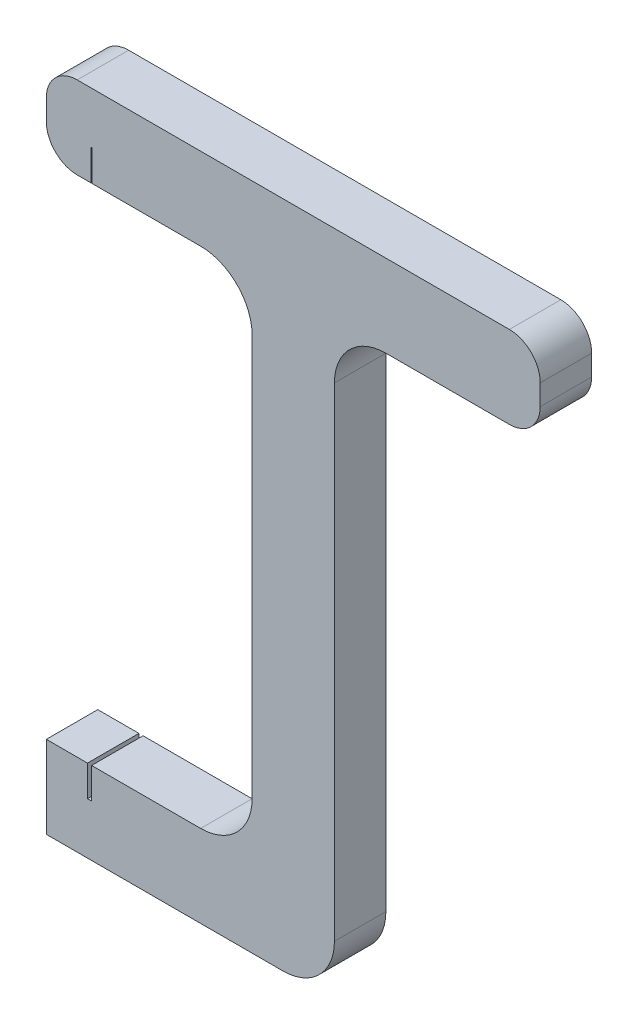
ISO-10303-21;
HEADER;
FILE_DESCRIPTION(('STEP AP214'),'2;1');
FILE_NAME('part.step','',(''),(''),'','','');
FILE_SCHEMA(('AUTOMOTIVE_DESIGN { 1 0 10303 214 1 1 1 1 }'));
ENDSEC;
DATA;
#1=APPLICATION_CONTEXT('core data for automotive mechanical design processes');
#2=APPLICATION_PROTOCOL_DEFINITION('international standard','automotive_design',2000,#1);
#3=PRODUCT_CONTEXT('',#1,'mechanical');
#4=PRODUCT('Part','Part','',(#3));
#5=PRODUCT_RELATED_PRODUCT_CATEGORY('part','',(#4));
#6=PRODUCT_DEFINITION_FORMATION('','',#4);
#7=PRODUCT_DEFINITION_CONTEXT('part definition',#1,'design');
#8=PRODUCT_DEFINITION('design','',#6,#7);
#9=PRODUCT_DEFINITION_SHAPE('','',#8);
#10=(LENGTH_UNIT() NAMED_UNIT(*) SI_UNIT(.MILLI.,.METRE.));
#11=(NAMED_UNIT(*) PLANE_ANGLE_UNIT() SI_UNIT($,.RADIAN.));
#12=(NAMED_UNIT(*) SI_UNIT($,.STERADIAN.) SOLID_ANGLE_UNIT());
#13=UNCERTAINTY_MEASURE_WITH_UNIT(LENGTH_MEASURE(1.E-05),#10,'distance_accuracy_value','');
#14=(GEOMETRIC_REPRESENTATION_CONTEXT(3) GLOBAL_UNCERTAINTY_ASSIGNED_CONTEXT((#13)) GLOBAL_UNIT_ASSIGNED_CONTEXT((#10,
#11,#12)) REPRESENTATION_CONTEXT('',''));
#15=CARTESIAN_POINT('',(0.,0.,0.));
#16=DIRECTION('',(0.,0.,1.));
#17=DIRECTION('',(1.,0.,0.));
#18=AXIS2_PLACEMENT_3D('',#15,#16,#17);
#19=CARTESIAN_POINT('',(-28.,57.,5.));
#20=DIRECTION('',(0.,1.,0.));
#21=DIRECTION('',(0.,0.,1.));
#22=AXIS2_PLACEMENT_3D('',#19,#20,#21);
#23=PLANE('',#22);
#24=DIRECTION('',(1.,0.,0.));
#25=VECTOR('',#24,1.);
#26=CARTESIAN_POINT('',(-28.,57.,0.));
#27=LINE('',#26,#25);
#28=CARTESIAN_POINT('',(-23.55,57.,0.));
#29=VERTEX_POINT('',#28);
#30=CARTESIAN_POINT('',(-13.,57.,0.));
#31=VERTEX_POINT('',#30);
#32=EDGE_CURVE('E316',#29,#31,#27,.T.);
#33=ORIENTED_EDGE('',*,*,#32,.T.);
#34=DIRECTION('',(0.,0.,-1.));
#35=VECTOR('',#34,1.);
#36=CARTESIAN_POINT('',(-13.,57.,5.));
#37=LINE('',#36,#35);
#38=CARTESIAN_POINT('',(-13.,57.,5.));
#39=VERTEX_POINT('',#38);
#40=EDGE_CURVE('E356',#31,#39,#37,.F.);
#41=ORIENTED_EDGE('',*,*,#40,.T.);
#42=DIRECTION('',(1.,0.,0.));
#43=VECTOR('',#42,1.);
#44=CARTESIAN_POINT('',(-28.,57.,5.));
#45=LINE('',#44,#43);
#46=CARTESIAN_POINT('',(-23.55,57.,4.99999999999999));
#47=VERTEX_POINT('',#46);
#48=EDGE_CURVE('E288',#47,#39,#45,.T.);
#49=ORIENTED_EDGE('',*,*,#48,.F.);
#50=DIRECTION('',(0.,0.,1.));
#51=VECTOR('',#50,1.);
#52=CARTESIAN_POINT('',(-23.55,57.,4.99999999999999));
#53=LINE('',#52,#51);
#54=EDGE_CURVE('E213',#29,#47,#53,.T.);
#55=ORIENTED_EDGE('',*,*,#54,.F.);
#56=EDGE_LOOP('',(#33,#41,#49,#55));
#57=FACE_BOUND('',#56,.T.);
#58=ADVANCED_FACE('F33',(#57),#23,.F.);
#59=CARTESIAN_POINT('',(-7.99999999999999,8.,5.));
#60=DIRECTION('',(0.,-1.,0.));
#61=DIRECTION('',(1.,0.,0.));
#62=AXIS2_PLACEMENT_3D('',#59,#60,#61);
#63=PLANE('',#62);
#64=DIRECTION('',(-1.,0.,0.));
#65=VECTOR('',#64,1.);
#66=CARTESIAN_POINT('',(-7.99999999999999,8.,5.));
#67=LINE('',#66,#65);
#68=CARTESIAN_POINT('',(-13.,8.,5.));
#69=VERTEX_POINT('',#68);
#70=CARTESIAN_POINT('',(-23.6,8.,5.));
#71=VERTEX_POINT('',#70);
#72=EDGE_CURVE('E295',#69,#71,#67,.T.);
#73=ORIENTED_EDGE('',*,*,#72,.F.);
#74=DIRECTION('',(0.,0.,-1.));
#75=VECTOR('',#74,1.);
#76=CARTESIAN_POINT('',(-13.,8.,0.));
#77=LINE('',#76,#75);
#78=CARTESIAN_POINT('',(-13.,8.,0.));
#79=VERTEX_POINT('',#78);
#80=EDGE_CURVE('E345',#69,#79,#77,.T.);
#81=ORIENTED_EDGE('',*,*,#80,.T.);
#82=DIRECTION('',(-1.,0.,0.));
#83=VECTOR('',#82,1.);
#84=CARTESIAN_POINT('',(-7.99999999999999,8.,0.));
#85=LINE('',#84,#83);
#86=CARTESIAN_POINT('',(-23.6,8.,0.));
#87=VERTEX_POINT('',#86);
#88=EDGE_CURVE('E323',#79,#87,#85,.T.);
#89=ORIENTED_EDGE('',*,*,#88,.T.);
#90=DIRECTION('',(0.,0.,-1.));
#91=VECTOR('',#90,1.);
#92=CARTESIAN_POINT('',(-23.6,8.,5.));
#93=LINE('',#92,#91);
#94=EDGE_CURVE('E242',#71,#87,#93,.T.);
#95=ORIENTED_EDGE('',*,*,#94,.F.);
#96=EDGE_LOOP('',(#73,#81,#89,#95));
#97=FACE_BOUND('',#96,.T.);
#98=ADVANCED_FACE('F436',(#97),#63,.F.);
#99=CARTESIAN_POINT('',(0.,0.,5.));
#100=DIRECTION('',(-1.,0.,0.));
#101=DIRECTION('',(0.,0.,1.));
#102=AXIS2_PLACEMENT_3D('',#99,#100,#101);
#103=PLANE('',#102);
#104=DIRECTION('',(0.,1.,0.));
#105=VECTOR('',#104,1.);
#106=CARTESIAN_POINT('',(0.,0.,5.));
#107=LINE('',#106,#105);
#108=CARTESIAN_POINT('',(0.,5.,5.));
#109=VERTEX_POINT('',#108);
#110=CARTESIAN_POINT('',(0.,52.,5.));
#111=VERTEX_POINT('',#110);
#112=EDGE_CURVE('E274',#109,#111,#107,.T.);
#113=ORIENTED_EDGE('',*,*,#112,.F.);
#114=DIRECTION('',(0.,0.,-1.));
#115=VECTOR('',#114,1.);
#116=CARTESIAN_POINT('',(0.,5.,5.));
#117=LINE('',#116,#115);
#118=CARTESIAN_POINT('',(0.,5.,0.));
#119=VERTEX_POINT('',#118);
#120=EDGE_CURVE('E336',#109,#119,#117,.T.);
#121=ORIENTED_EDGE('',*,*,#120,.T.);
#122=DIRECTION('',(0.,1.,0.));
#123=VECTOR('',#122,1.);
#124=CARTESIAN_POINT('',(0.,0.,0.));
#125=LINE('',#124,#123);
#126=CARTESIAN_POINT('',(0.,52.,0.));
#127=VERTEX_POINT('',#126);
#128=EDGE_CURVE('E266',#119,#127,#125,.T.);
#129=ORIENTED_EDGE('',*,*,#128,.T.);
#130=DIRECTION('',(0.,0.,-1.));
#131=VECTOR('',#130,1.);
#132=CARTESIAN_POINT('',(0.,52.,5.));
#133=LINE('',#132,#131);
#134=EDGE_CURVE('E334',#127,#111,#133,.F.);
#135=ORIENTED_EDGE('',*,*,#134,.T.);
#136=EDGE_LOOP('',(#113,#121,#129,#135));
#137=FACE_BOUND('',#136,.T.);
#138=ADVANCED_FACE('F468',(#137),#103,.F.);
#139=CARTESIAN_POINT('',(0.,57.,5.));
#140=DIRECTION('',(0.,1.,0.));
#141=DIRECTION('',(0.,0.,1.));
#142=AXIS2_PLACEMENT_3D('',#139,#140,#141);
#143=PLANE('',#142);
#144=DIRECTION('',(1.,0.,0.));
#145=VECTOR('',#144,1.);
#146=CARTESIAN_POINT('',(0.,57.,0.));
#147=LINE('',#146,#145);
#148=CARTESIAN_POINT('',(5.,57.,0.));
#149=VERTEX_POINT('',#148);
#150=CARTESIAN_POINT('',(17.,57.,0.));
#151=VERTEX_POINT('',#150);
#152=EDGE_CURVE('E305',#149,#151,#147,.T.);
#153=ORIENTED_EDGE('',*,*,#152,.T.);
#154=DIRECTION('',(0.,0.,-1.));
#155=VECTOR('',#154,1.);
#156=CARTESIAN_POINT('',(17.,57.,5.));
#157=LINE('',#156,#155);
#158=CARTESIAN_POINT('',(17.,57.,5.));
#159=VERTEX_POINT('',#158);
#160=EDGE_CURVE('E383',#151,#159,#157,.F.);
#161=ORIENTED_EDGE('',*,*,#160,.T.);
#162=DIRECTION('',(1.,0.,0.));
#163=VECTOR('',#162,1.);
#164=CARTESIAN_POINT('',(0.,57.,5.));
#165=LINE('',#164,#163);
#166=CARTESIAN_POINT('',(5.,57.,5.));
#167=VERTEX_POINT('',#166);
#168=EDGE_CURVE('E277',#167,#159,#165,.T.);
#169=ORIENTED_EDGE('',*,*,#168,.F.);
#170=DIRECTION('',(0.,0.,-1.));
#171=VECTOR('',#170,1.);
#172=CARTESIAN_POINT('',(5.,57.,0.));
#173=LINE('',#172,#171);
#174=EDGE_CURVE('E353',#167,#149,#173,.T.);
#175=ORIENTED_EDGE('',*,*,#174,.T.);
#176=EDGE_LOOP('',(#153,#161,#169,#175));
#177=FACE_BOUND('',#176,.T.);
#178=ADVANCED_FACE('F478',(#177),#143,.F.);
#179=CARTESIAN_POINT('',(20.,57.,5.));
#180=DIRECTION('',(-1.,0.,0.));
#181=DIRECTION('',(0.,0.,1.));
#182=AXIS2_PLACEMENT_3D('',#179,#180,#181);
#183=PLANE('',#182);
#184=DIRECTION('',(0.,1.,0.));
#185=VECTOR('',#184,1.);
#186=CARTESIAN_POINT('',(20.,57.,5.));
#187=LINE('',#186,#185);
#188=CARTESIAN_POINT('',(20.,60.,5.));
#189=VERTEX_POINT('',#188);
#190=CARTESIAN_POINT('',(20.,62.,5.));
#191=VERTEX_POINT('',#190);
#192=EDGE_CURVE('E280',#189,#191,#187,.T.);
#193=ORIENTED_EDGE('',*,*,#192,.F.);
#194=DIRECTION('',(0.,0.,-1.));
#195=VECTOR('',#194,1.);
#196=CARTESIAN_POINT('',(20.,60.,5.));
#197=LINE('',#196,#195);
#198=CARTESIAN_POINT('',(20.,60.,0.));
#199=VERTEX_POINT('',#198);
#200=EDGE_CURVE('E372',#189,#199,#197,.T.);
#201=ORIENTED_EDGE('',*,*,#200,.T.);
#202=DIRECTION('',(0.,1.,0.));
#203=VECTOR('',#202,1.);
#204=CARTESIAN_POINT('',(20.,57.,0.));
#205=LINE('',#204,#203);
#206=CARTESIAN_POINT('',(20.,62.,0.));
#207=VERTEX_POINT('',#206);
#208=EDGE_CURVE('E308',#199,#207,#205,.T.);
#209=ORIENTED_EDGE('',*,*,#208,.T.);
#210=DIRECTION('',(0.,0.,-1.));
#211=VECTOR('',#210,1.);
#212=CARTESIAN_POINT('',(20.,62.,5.));
#213=LINE('',#212,#211);
#214=EDGE_CURVE('E370',#207,#191,#213,.F.);
#215=ORIENTED_EDGE('',*,*,#214,.T.);
#216=EDGE_LOOP('',(#193,#201,#209,#215));
#217=FACE_BOUND('',#216,.T.);
#218=ADVANCED_FACE('F486',(#217),#183,.F.);
#219=CARTESIAN_POINT('',(0.,65.,5.));
#220=DIRECTION('',(0.,-1.,0.));
#221=DIRECTION('',(0.,0.,-1.));
#222=AXIS2_PLACEMENT_3D('',#219,#220,#221);
#223=PLANE('',#222);
#224=DIRECTION('',(-1.,0.,0.));
#225=VECTOR('',#224,1.);
#226=CARTESIAN_POINT('',(20.,65.,5.));
#227=LINE('',#226,#225);
#228=CARTESIAN_POINT('',(17.,65.,5.));
#229=VERTEX_POINT('',#228);
#230=CARTESIAN_POINT('',(-25.,65.,5.));
#231=VERTEX_POINT('',#230);
#232=EDGE_CURVE('E283',#229,#231,#227,.T.);
#233=ORIENTED_EDGE('',*,*,#232,.F.);
#234=DIRECTION('',(0.,0.,-1.));
#235=VECTOR('',#234,1.);
#236=CARTESIAN_POINT('',(17.,65.,5.));
#237=LINE('',#236,#235);
#238=CARTESIAN_POINT('',(17.,65.,0.));
#239=VERTEX_POINT('',#238);
#240=EDGE_CURVE('E394',#229,#239,#237,.T.);
#241=ORIENTED_EDGE('',*,*,#240,.T.);
#242=DIRECTION('',(-1.,0.,0.));
#243=VECTOR('',#242,1.);
#244=CARTESIAN_POINT('',(0.,65.,0.));
#245=LINE('',#244,#243);
#246=CARTESIAN_POINT('',(-25.,65.,0.));
#247=VERTEX_POINT('',#246);
#248=EDGE_CURVE('E311',#239,#247,#245,.T.);
#249=ORIENTED_EDGE('',*,*,#248,.T.);
#250=DIRECTION('',(0.,0.,-1.));
#251=VECTOR('',#250,1.);
#252=CARTESIAN_POINT('',(-25.,65.,5.));
#253=LINE('',#252,#251);
#254=EDGE_CURVE('E392',#247,#231,#253,.F.);
#255=ORIENTED_EDGE('',*,*,#254,.T.);
#256=EDGE_LOOP('',(#233,#241,#249,#255));
#257=FACE_BOUND('',#256,.T.);
#258=ADVANCED_FACE('F494',(#257),#223,.F.);
#259=CARTESIAN_POINT('',(-28.,65.,5.));
#260=DIRECTION('',(1.,0.,0.));
#261=DIRECTION('',(0.,0.,-1.));
#262=AXIS2_PLACEMENT_3D('',#259,#260,#261);
#263=PLANE('',#262);
#264=DIRECTION('',(0.,-1.,0.));
#265=VECTOR('',#264,1.);
#266=CARTESIAN_POINT('',(-28.,65.,5.));
#267=LINE('',#266,#265);
#268=CARTESIAN_POINT('',(-28.,62.,5.));
#269=VERTEX_POINT('',#268);
#270=CARTESIAN_POINT('',(-28.,60.,5.));
#271=VERTEX_POINT('',#270);
#272=EDGE_CURVE('E286',#269,#271,#267,.T.);
#273=ORIENTED_EDGE('',*,*,#272,.F.);
#274=DIRECTION('',(0.,0.,-1.));
#275=VECTOR('',#274,1.);
#276=CARTESIAN_POINT('',(-28.,62.,5.));
#277=LINE('',#276,#275);
#278=CARTESIAN_POINT('',(-28.,62.,0.));
#279=VERTEX_POINT('',#278);
#280=EDGE_CURVE('E41',#269,#279,#277,.T.);
#281=ORIENTED_EDGE('',*,*,#280,.T.);
#282=DIRECTION('',(0.,-1.,0.));
#283=VECTOR('',#282,1.);
#284=CARTESIAN_POINT('',(-28.,65.,0.));
#285=LINE('',#284,#283);
#286=CARTESIAN_POINT('',(-28.,60.,0.));
#287=VERTEX_POINT('',#286);
#288=EDGE_CURVE('E314',#279,#287,#285,.T.);
#289=ORIENTED_EDGE('',*,*,#288,.T.);
#290=DIRECTION('',(0.,0.,-1.));
#291=VECTOR('',#290,1.);
#292=CARTESIAN_POINT('',(-28.,60.,5.));
#293=LINE('',#292,#291);
#294=EDGE_CURVE('E56',#287,#271,#293,.F.);
#295=ORIENTED_EDGE('',*,*,#294,.T.);
#296=EDGE_LOOP('',(#273,#281,#289,#295));
#297=FACE_BOUND('',#296,.T.);
#298=ADVANCED_FACE('F400',(#297),#263,.F.);
#299=CARTESIAN_POINT('',(-25.,57.,5.));
#300=VERTEX_POINT('',#299);
#301=CARTESIAN_POINT('',(-23.65,57.,4.99999999999999));
#302=VERTEX_POINT('',#301);
#303=EDGE_CURVE('E289',#300,#302,#45,.T.);
#304=ORIENTED_EDGE('',*,*,#303,.F.);
#305=DIRECTION('',(0.,0.,-1.));
#306=VECTOR('',#305,1.);
#307=CARTESIAN_POINT('',(-25.,57.,5.));
#308=LINE('',#307,#306);
#309=CARTESIAN_POINT('',(-25.,57.,0.));
#310=VERTEX_POINT('',#309);
#311=EDGE_CURVE('E11',#300,#310,#308,.T.);
#312=ORIENTED_EDGE('',*,*,#311,.T.);
#313=CARTESIAN_POINT('',(-23.65,57.,0.));
#314=VERTEX_POINT('',#313);
#315=EDGE_CURVE('E317',#310,#314,#27,.T.);
#316=ORIENTED_EDGE('',*,*,#315,.T.);
#317=DIRECTION('',(0.,0.,-1.));
#318=VECTOR('',#317,1.);
#319=CARTESIAN_POINT('',(-23.65,57.,4.99999999999999));
#320=LINE('',#319,#318);
#321=EDGE_CURVE('E227',#302,#314,#320,.T.);
#322=ORIENTED_EDGE('',*,*,#321,.F.);
#323=EDGE_LOOP('',(#304,#312,#316,#322));
#324=FACE_BOUND('',#323,.T.);
#325=ADVANCED_FACE('F411',(#324),#23,.F.);
#326=CARTESIAN_POINT('',(-8.,57.,5.));
#327=DIRECTION('',(1.,0.,0.));
#328=DIRECTION('',(0.,1.,0.));
#329=AXIS2_PLACEMENT_3D('',#326,#327,#328);
#330=PLANE('',#329);
#331=DIRECTION('',(0.,-1.,0.));
#332=VECTOR('',#331,1.);
#333=CARTESIAN_POINT('',(-8.,57.,0.));
#334=LINE('',#333,#332);
#335=CARTESIAN_POINT('',(-8.,52.,0.));
#336=VERTEX_POINT('',#335);
#337=CARTESIAN_POINT('',(-7.99999999999999,13.,0.));
#338=VERTEX_POINT('',#337);
#339=EDGE_CURVE('E319',#336,#338,#334,.T.);
#340=ORIENTED_EDGE('',*,*,#339,.T.);
#341=DIRECTION('',(0.,0.,-1.));
#342=VECTOR('',#341,1.);
#343=CARTESIAN_POINT('',(-7.99999999999999,13.,5.));
#344=LINE('',#343,#342);
#345=CARTESIAN_POINT('',(-7.99999999999999,13.,5.));
#346=VERTEX_POINT('',#345);
#347=EDGE_CURVE('E351',#338,#346,#344,.F.);
#348=ORIENTED_EDGE('',*,*,#347,.T.);
#349=DIRECTION('',(0.,-1.,0.));
#350=VECTOR('',#349,1.);
#351=CARTESIAN_POINT('',(-8.,57.,5.));
#352=LINE('',#351,#350);
#353=CARTESIAN_POINT('',(-8.,52.,5.));
#354=VERTEX_POINT('',#353);
#355=EDGE_CURVE('E291',#354,#346,#352,.T.);
#356=ORIENTED_EDGE('',*,*,#355,.F.);
#357=DIRECTION('',(0.,0.,-1.));
#358=VECTOR('',#357,1.);
#359=CARTESIAN_POINT('',(-8.,52.,0.));
#360=LINE('',#359,#358);
#361=EDGE_CURVE('E348',#354,#336,#360,.T.);
#362=ORIENTED_EDGE('',*,*,#361,.T.);
#363=EDGE_LOOP('',(#340,#348,#356,#362));
#364=FACE_BOUND('',#363,.T.);
#365=ADVANCED_FACE('F427',(#364),#330,.F.);
#366=CARTESIAN_POINT('',(-24.,8.,5.));
#367=VERTEX_POINT('',#366);
#368=CARTESIAN_POINT('',(-28.,8.,5.));
#369=VERTEX_POINT('',#368);
#370=EDGE_CURVE('E294',#367,#369,#67,.T.);
#371=ORIENTED_EDGE('',*,*,#370,.F.);
#372=DIRECTION('',(0.,0.,1.));
#373=VECTOR('',#372,1.);
#374=CARTESIAN_POINT('',(-24.,8.,5.));
#375=LINE('',#374,#373);
#376=CARTESIAN_POINT('',(-24.,8.,0.));
#377=VERTEX_POINT('',#376);
#378=EDGE_CURVE('E250',#377,#367,#375,.T.);
#379=ORIENTED_EDGE('',*,*,#378,.F.);
#380=CARTESIAN_POINT('',(-28.,8.,0.));
#381=VERTEX_POINT('',#380);
#382=EDGE_CURVE('E322',#377,#381,#85,.T.);
#383=ORIENTED_EDGE('',*,*,#382,.T.);
#384=DIRECTION('',(0.,0.,-1.));
#385=VECTOR('',#384,1.);
#386=CARTESIAN_POINT('',(-28.,8.,5.));
#387=LINE('',#386,#385);
#388=EDGE_CURVE('E331',#369,#381,#387,.T.);
#389=ORIENTED_EDGE('',*,*,#388,.F.);
#390=EDGE_LOOP('',(#371,#379,#383,#389));
#391=FACE_BOUND('',#390,.T.);
#392=ADVANCED_FACE('F451',(#391),#63,.F.);
#393=CARTESIAN_POINT('',(-28.,8.,5.));
#394=DIRECTION('',(1.,0.,0.));
#395=DIRECTION('',(0.,0.,-1.));
#396=AXIS2_PLACEMENT_3D('',#393,#394,#395);
#397=PLANE('',#396);
#398=DIRECTION('',(0.,-1.,0.));
#399=VECTOR('',#398,1.);
#400=CARTESIAN_POINT('',(-28.,8.,0.));
#401=LINE('',#400,#399);
#402=CARTESIAN_POINT('',(-28.,0.,0.));
#403=VERTEX_POINT('',#402);
#404=EDGE_CURVE('E325',#381,#403,#401,.T.);
#405=ORIENTED_EDGE('',*,*,#404,.T.);
#406=DIRECTION('',(0.,0.,-1.));
#407=VECTOR('',#406,1.);
#408=CARTESIAN_POINT('',(-28.,0.,5.));
#409=LINE('',#408,#407);
#410=CARTESIAN_POINT('',(-28.,0.,5.));
#411=VERTEX_POINT('',#410);
#412=EDGE_CURVE('E302',#411,#403,#409,.T.);
#413=ORIENTED_EDGE('',*,*,#412,.F.);
#414=DIRECTION('',(0.,-1.,0.));
#415=VECTOR('',#414,1.);
#416=CARTESIAN_POINT('',(-28.,8.,5.));
#417=LINE('',#416,#415);
#418=EDGE_CURVE('E297',#369,#411,#417,.T.);
#419=ORIENTED_EDGE('',*,*,#418,.F.);
#420=ORIENTED_EDGE('',*,*,#388,.T.);
#421=EDGE_LOOP('',(#405,#413,#419,#420));
#422=FACE_BOUND('',#421,.T.);
#423=ADVANCED_FACE('F457',(#422),#397,.F.);
#424=CARTESIAN_POINT('',(-28.,0.,5.));
#425=DIRECTION('',(0.,1.,0.));
#426=DIRECTION('',(-1.,0.,0.));
#427=AXIS2_PLACEMENT_3D('',#424,#425,#426);
#428=PLANE('',#427);
#429=DIRECTION('',(1.,0.,0.));
#430=VECTOR('',#429,1.);
#431=CARTESIAN_POINT('',(-28.,0.,0.));
#432=LINE('',#431,#430);
#433=CARTESIAN_POINT('',(-5.00000000000001,0.,0.));
#434=VERTEX_POINT('',#433);
#435=EDGE_CURVE('E278',#403,#434,#432,.T.);
#436=ORIENTED_EDGE('',*,*,#435,.T.);
#437=DIRECTION('',(0.,0.,-1.));
#438=VECTOR('',#437,1.);
#439=CARTESIAN_POINT('',(-5.,0.,5.));
#440=LINE('',#439,#438);
#441=CARTESIAN_POINT('',(-5.00000000000001,0.,5.));
#442=VERTEX_POINT('',#441);
#443=EDGE_CURVE('E341',#434,#442,#440,.F.);
#444=ORIENTED_EDGE('',*,*,#443,.T.);
#445=DIRECTION('',(1.,0.,0.));
#446=VECTOR('',#445,1.);
#447=CARTESIAN_POINT('',(-28.,0.,5.));
#448=LINE('',#447,#446);
#449=EDGE_CURVE('E299',#411,#442,#448,.T.);
#450=ORIENTED_EDGE('',*,*,#449,.F.);
#451=ORIENTED_EDGE('',*,*,#412,.T.);
#452=EDGE_LOOP('',(#436,#444,#450,#451));
#453=FACE_BOUND('',#452,.T.);
#454=ADVANCED_FACE('F648',(#453),#428,.F.);
#455=CARTESIAN_POINT('',(0.,0.,5.));
#456=DIRECTION('',(0.,0.,-1.));
#457=DIRECTION('',(-1.,0.,0.));
#458=AXIS2_PLACEMENT_3D('',#455,#456,#457);
#459=PLANE('',#458);
#460=ORIENTED_EDGE('',*,*,#168,.T.);
#461=CARTESIAN_POINT('',(17.,60.,5.));
#462=DIRECTION('',(0.,0.,-1.));
#463=DIRECTION('',(-1.,0.,0.));
#464=AXIS2_PLACEMENT_3D('',#461,#462,#463);
#465=CIRCLE('',#464,3.);
#466=EDGE_CURVE('E390',#159,#189,#465,.F.);
#467=ORIENTED_EDGE('',*,*,#466,.T.);
#468=ORIENTED_EDGE('',*,*,#192,.T.);
#469=CARTESIAN_POINT('',(17.,62.,5.));
#470=DIRECTION('',(0.,0.,-1.));
#471=DIRECTION('',(-1.,0.,0.));
#472=AXIS2_PLACEMENT_3D('',#469,#470,#471);
#473=CIRCLE('',#472,3.);
#474=EDGE_CURVE('E388',#191,#229,#473,.F.);
#475=ORIENTED_EDGE('',*,*,#474,.T.);
#476=ORIENTED_EDGE('',*,*,#232,.T.);
#477=CARTESIAN_POINT('',(-25.,62.,5.));
#478=DIRECTION('',(0.,0.,-1.));
#479=DIRECTION('',(-1.,0.,0.));
#480=AXIS2_PLACEMENT_3D('',#477,#478,#479);
#481=CIRCLE('',#480,3.);
#482=EDGE_CURVE('E386',#231,#269,#481,.F.);
#483=ORIENTED_EDGE('',*,*,#482,.T.);
#484=ORIENTED_EDGE('',*,*,#272,.T.);
#485=CARTESIAN_POINT('',(-25.,60.,5.));
#486=DIRECTION('',(0.,0.,-1.));
#487=DIRECTION('',(-1.,0.,0.));
#488=AXIS2_PLACEMENT_3D('',#485,#486,#487);
#489=CIRCLE('',#488,3.);
#490=EDGE_CURVE('E48',#271,#300,#489,.F.);
#491=ORIENTED_EDGE('',*,*,#490,.T.);
#492=ORIENTED_EDGE('',*,*,#303,.T.);
#493=DIRECTION('',(0.,-1.,0.));
#494=VECTOR('',#493,1.);
#495=CARTESIAN_POINT('',(-23.65,60.,4.99999999999999));
#496=LINE('',#495,#494);
#497=CARTESIAN_POINT('',(-23.65,60.,4.99999999999999));
#498=VERTEX_POINT('',#497);
#499=EDGE_CURVE('E217',#498,#302,#496,.T.);
#500=ORIENTED_EDGE('',*,*,#499,.F.);
#501=DIRECTION('',(-1.,0.,0.));
#502=VECTOR('',#501,1.);
#503=CARTESIAN_POINT('',(-23.65,60.,4.99999999999999));
#504=LINE('',#503,#502);
#505=CARTESIAN_POINT('',(-23.55,60.,4.99999999999999));
#506=VERTEX_POINT('',#505);
#507=EDGE_CURVE('E223',#506,#498,#504,.T.);
#508=ORIENTED_EDGE('',*,*,#507,.F.);
#509=DIRECTION('',(0.,-1.,0.));
#510=VECTOR('',#509,1.);
#511=CARTESIAN_POINT('',(-23.55,60.,4.99999999999999));
#512=LINE('',#511,#510);
#513=EDGE_CURVE('E207',#506,#47,#512,.T.);
#514=ORIENTED_EDGE('',*,*,#513,.T.);
#515=ORIENTED_EDGE('',*,*,#48,.T.);
#516=CARTESIAN_POINT('',(-13.,52.,5.));
#517=DIRECTION('',(0.,0.,-1.));
#518=DIRECTION('',(-1.,0.,0.));
#519=AXIS2_PLACEMENT_3D('',#516,#517,#518);
#520=CIRCLE('',#519,5.);
#521=EDGE_CURVE('E368',#39,#354,#520,.T.);
#522=ORIENTED_EDGE('',*,*,#521,.T.);
#523=ORIENTED_EDGE('',*,*,#355,.T.);
#524=CARTESIAN_POINT('',(-13.,13.,5.));
#525=DIRECTION('',(0.,0.,-1.));
#526=DIRECTION('',(-1.,0.,0.));
#527=AXIS2_PLACEMENT_3D('',#524,#525,#526);
#528=CIRCLE('',#527,5.);
#529=EDGE_CURVE('E360',#346,#69,#528,.T.);
#530=ORIENTED_EDGE('',*,*,#529,.T.);
#531=ORIENTED_EDGE('',*,*,#72,.T.);
#532=DIRECTION('',(0.,1.,0.));
#533=VECTOR('',#532,1.);
#534=CARTESIAN_POINT('',(-23.6,5.,5.));
#535=LINE('',#534,#533);
#536=CARTESIAN_POINT('',(-23.6,5.,5.));
#537=VERTEX_POINT('',#536);
#538=EDGE_CURVE('E263',#537,#71,#535,.T.);
#539=ORIENTED_EDGE('',*,*,#538,.F.);
#540=DIRECTION('',(1.,0.,0.));
#541=VECTOR('',#540,1.);
#542=CARTESIAN_POINT('',(-24.,5.,5.));
#543=LINE('',#542,#541);
#544=CARTESIAN_POINT('',(-24.,5.,5.));
#545=VERTEX_POINT('',#544);
#546=EDGE_CURVE('E256',#545,#537,#543,.T.);
#547=ORIENTED_EDGE('',*,*,#546,.F.);
#548=DIRECTION('',(0.,1.,0.));
#549=VECTOR('',#548,1.);
#550=CARTESIAN_POINT('',(-24.,5.,5.));
#551=LINE('',#550,#549);
#552=EDGE_CURVE('E267',#545,#367,#551,.T.);
#553=ORIENTED_EDGE('',*,*,#552,.T.);
#554=ORIENTED_EDGE('',*,*,#370,.T.);
#555=ORIENTED_EDGE('',*,*,#418,.T.);
#556=ORIENTED_EDGE('',*,*,#449,.T.);
#557=CARTESIAN_POINT('',(-5.,5.,5.));
#558=DIRECTION('',(0.,0.,-1.));
#559=DIRECTION('',(-1.,0.,0.));
#560=AXIS2_PLACEMENT_3D('',#557,#558,#559);
#561=CIRCLE('',#560,5.);
#562=EDGE_CURVE('E343',#442,#109,#561,.F.);
#563=ORIENTED_EDGE('',*,*,#562,.T.);
#564=ORIENTED_EDGE('',*,*,#112,.T.);
#565=CARTESIAN_POINT('',(5.,52.,5.));
#566=DIRECTION('',(0.,0.,-1.));
#567=DIRECTION('',(-1.,0.,0.));
#568=AXIS2_PLACEMENT_3D('',#565,#566,#567);
#569=CIRCLE('',#568,5.);
#570=EDGE_CURVE('E364',#111,#167,#569,.T.);
#571=ORIENTED_EDGE('',*,*,#570,.T.);
#572=EDGE_LOOP('',(#460,#467,#468,#475,#476,#483,#484,#491,#492,#500,#508,#514,#515,#522,#523,
#530,#531,#539,#547,#553,#554,#555,#556,#563,#564,#571));
#573=FACE_BOUND('',#572,.T.);
#574=ADVANCED_FACE('F230',(#573),#459,.F.);
#575=CARTESIAN_POINT('',(0.,0.,0.));
#576=DIRECTION('',(0.,0.,-1.));
#577=DIRECTION('',(-1.,0.,0.));
#578=AXIS2_PLACEMENT_3D('',#575,#576,#577);
#579=PLANE('',#578);
#580=ORIENTED_EDGE('',*,*,#208,.F.);
#581=CARTESIAN_POINT('',(17.,60.,0.));
#582=DIRECTION('',(0.,0.,-1.));
#583=DIRECTION('',(-1.,0.,0.));
#584=AXIS2_PLACEMENT_3D('',#581,#582,#583);
#585=CIRCLE('',#584,3.);
#586=EDGE_CURVE('E381',#199,#151,#585,.T.);
#587=ORIENTED_EDGE('',*,*,#586,.T.);
#588=ORIENTED_EDGE('',*,*,#152,.F.);
#589=CARTESIAN_POINT('',(5.,52.,0.));
#590=DIRECTION('',(0.,0.,-1.));
#591=DIRECTION('',(-1.,0.,0.));
#592=AXIS2_PLACEMENT_3D('',#589,#590,#591);
#593=CIRCLE('',#592,5.);
#594=EDGE_CURVE('E362',#149,#127,#593,.F.);
#595=ORIENTED_EDGE('',*,*,#594,.T.);
#596=ORIENTED_EDGE('',*,*,#128,.F.);
#597=CARTESIAN_POINT('',(-5.,5.,0.));
#598=DIRECTION('',(0.,0.,-1.));
#599=DIRECTION('',(-1.,0.,0.));
#600=AXIS2_PLACEMENT_3D('',#597,#598,#599);
#601=CIRCLE('',#600,5.);
#602=EDGE_CURVE('E339',#119,#434,#601,.T.);
#603=ORIENTED_EDGE('',*,*,#602,.T.);
#604=ORIENTED_EDGE('',*,*,#435,.F.);
#605=ORIENTED_EDGE('',*,*,#404,.F.);
#606=ORIENTED_EDGE('',*,*,#382,.F.);
#607=DIRECTION('',(0.,1.,0.));
#608=VECTOR('',#607,1.);
#609=CARTESIAN_POINT('',(-24.,5.,0.));
#610=LINE('',#609,#608);
#611=CARTESIAN_POINT('',(-24.,5.,0.));
#612=VERTEX_POINT('',#611);
#613=EDGE_CURVE('E270',#612,#377,#610,.T.);
#614=ORIENTED_EDGE('',*,*,#613,.F.);
#615=DIRECTION('',(-1.,0.,0.));
#616=VECTOR('',#615,1.);
#617=CARTESIAN_POINT('',(-24.,5.,0.));
#618=LINE('',#617,#616);
#619=CARTESIAN_POINT('',(-23.6,5.,0.));
#620=VERTEX_POINT('',#619);
#621=EDGE_CURVE('E249',#620,#612,#618,.T.);
#622=ORIENTED_EDGE('',*,*,#621,.F.);
#623=DIRECTION('',(0.,1.,0.));
#624=VECTOR('',#623,1.);
#625=CARTESIAN_POINT('',(-23.6,5.,0.));
#626=LINE('',#625,#624);
#627=EDGE_CURVE('E259',#620,#87,#626,.T.);
#628=ORIENTED_EDGE('',*,*,#627,.T.);
#629=ORIENTED_EDGE('',*,*,#88,.F.);
#630=CARTESIAN_POINT('',(-13.,13.,0.));
#631=DIRECTION('',(0.,0.,-1.));
#632=DIRECTION('',(-1.,0.,0.));
#633=AXIS2_PLACEMENT_3D('',#630,#631,#632);
#634=CIRCLE('',#633,5.);
#635=EDGE_CURVE('E358',#79,#338,#634,.F.);
#636=ORIENTED_EDGE('',*,*,#635,.T.);
#637=ORIENTED_EDGE('',*,*,#339,.F.);
#638=CARTESIAN_POINT('',(-13.,52.,0.));
#639=DIRECTION('',(0.,0.,-1.));
#640=DIRECTION('',(-1.,0.,0.));
#641=AXIS2_PLACEMENT_3D('',#638,#639,#640);
#642=CIRCLE('',#641,5.);
#643=EDGE_CURVE('E366',#336,#31,#642,.F.);
#644=ORIENTED_EDGE('',*,*,#643,.T.);
#645=ORIENTED_EDGE('',*,*,#32,.F.);
#646=DIRECTION('',(0.,-1.,0.));
#647=VECTOR('',#646,1.);
#648=CARTESIAN_POINT('',(-23.55,60.,0.));
#649=LINE('',#648,#647);
#650=CARTESIAN_POINT('',(-23.55,60.,0.));
#651=VERTEX_POINT('',#650);
#652=EDGE_CURVE('E240',#651,#29,#649,.T.);
#653=ORIENTED_EDGE('',*,*,#652,.F.);
#654=DIRECTION('',(1.,0.,0.));
#655=VECTOR('',#654,1.);
#656=CARTESIAN_POINT('',(-23.65,60.,0.));
#657=LINE('',#656,#655);
#658=CARTESIAN_POINT('',(-23.65,60.,0.));
#659=VERTEX_POINT('',#658);
#660=EDGE_CURVE('E218',#659,#651,#657,.T.);
#661=ORIENTED_EDGE('',*,*,#660,.F.);
#662=DIRECTION('',(0.,-1.,0.));
#663=VECTOR('',#662,1.);
#664=CARTESIAN_POINT('',(-23.65,60.,0.));
#665=LINE('',#664,#663);
#666=EDGE_CURVE('E243',#659,#314,#665,.T.);
#667=ORIENTED_EDGE('',*,*,#666,.T.);
#668=ORIENTED_EDGE('',*,*,#315,.F.);
#669=CARTESIAN_POINT('',(-25.,60.,0.));
#670=DIRECTION('',(0.,0.,-1.));
#671=DIRECTION('',(-1.,0.,0.));
#672=AXIS2_PLACEMENT_3D('',#669,#670,#671);
#673=CIRCLE('',#672,3.);
#674=EDGE_CURVE('E375',#310,#287,#673,.T.);
#675=ORIENTED_EDGE('',*,*,#674,.T.);
#676=ORIENTED_EDGE('',*,*,#288,.F.);
#677=CARTESIAN_POINT('',(-25.,62.,0.));
#678=DIRECTION('',(0.,0.,-1.));
#679=DIRECTION('',(-1.,0.,0.));
#680=AXIS2_PLACEMENT_3D('',#677,#678,#679);
#681=CIRCLE('',#680,3.);
#682=EDGE_CURVE('E377',#279,#247,#681,.T.);
#683=ORIENTED_EDGE('',*,*,#682,.T.);
#684=ORIENTED_EDGE('',*,*,#248,.F.);
#685=CARTESIAN_POINT('',(17.,62.,0.));
#686=DIRECTION('',(0.,0.,-1.));
#687=DIRECTION('',(-1.,0.,0.));
#688=AXIS2_PLACEMENT_3D('',#685,#686,#687);
#689=CIRCLE('',#688,3.);
#690=EDGE_CURVE('E379',#239,#207,#689,.T.);
#691=ORIENTED_EDGE('',*,*,#690,.T.);
#692=EDGE_LOOP('',(#580,#587,#588,#595,#596,#603,#604,#605,#606,#614,#622,#628,#629,#636,#637,
#644,#645,#653,#661,#667,#668,#675,#676,#683,#684,#691));
#693=FACE_BOUND('',#692,.T.);
#694=ADVANCED_FACE('F405',(#693),#579,.T.);
#695=CARTESIAN_POINT('',(-23.6,5.,5.));
#696=DIRECTION('',(1.,0.,0.));
#697=DIRECTION('',(0.,1.,0.));
#698=AXIS2_PLACEMENT_3D('',#695,#696,#697);
#699=PLANE('',#698);
#700=ORIENTED_EDGE('',*,*,#94,.T.);
#701=ORIENTED_EDGE('',*,*,#627,.F.);
#702=DIRECTION('',(0.,0.,-1.));
#703=VECTOR('',#702,1.);
#704=CARTESIAN_POINT('',(-23.6,5.,5.));
#705=LINE('',#704,#703);
#706=EDGE_CURVE('E247',#537,#620,#705,.T.);
#707=ORIENTED_EDGE('',*,*,#706,.F.);
#708=ORIENTED_EDGE('',*,*,#538,.T.);
#709=EDGE_LOOP('',(#700,#701,#707,#708));
#710=FACE_BOUND('',#709,.T.);
#711=ADVANCED_FACE('F441',(#710),#699,.F.);
#712=CARTESIAN_POINT('',(-24.,5.,5.));
#713=DIRECTION('',(-1.,0.,0.));
#714=DIRECTION('',(0.,-1.,0.));
#715=AXIS2_PLACEMENT_3D('',#712,#713,#714);
#716=PLANE('',#715);
#717=ORIENTED_EDGE('',*,*,#378,.T.);
#718=ORIENTED_EDGE('',*,*,#552,.F.);
#719=DIRECTION('',(0.,0.,1.));
#720=VECTOR('',#719,1.);
#721=CARTESIAN_POINT('',(-24.,5.,5.));
#722=LINE('',#721,#720);
#723=EDGE_CURVE('E253',#612,#545,#722,.T.);
#724=ORIENTED_EDGE('',*,*,#723,.F.);
#725=ORIENTED_EDGE('',*,*,#613,.T.);
#726=EDGE_LOOP('',(#717,#718,#724,#725));
#727=FACE_BOUND('',#726,.T.);
#728=ADVANCED_FACE('F614',(#727),#716,.F.);
#729=CARTESIAN_POINT('',(0.,5.,0.));
#730=DIRECTION('',(0.,-1.,0.));
#731=DIRECTION('',(0.,0.,-1.));
#732=AXIS2_PLACEMENT_3D('',#729,#730,#731);
#733=PLANE('',#732);
#734=ORIENTED_EDGE('',*,*,#706,.T.);
#735=ORIENTED_EDGE('',*,*,#621,.T.);
#736=ORIENTED_EDGE('',*,*,#723,.T.);
#737=ORIENTED_EDGE('',*,*,#546,.T.);
#738=EDGE_LOOP('',(#734,#735,#736,#737));
#739=FACE_BOUND('',#738,.T.);
#740=ADVANCED_FACE('F445',(#739),#733,.F.);
#741=CARTESIAN_POINT('',(-23.55,60.,4.99999999999999));
#742=DIRECTION('',(1.,0.,0.));
#743=DIRECTION('',(0.,0.,-1.));
#744=AXIS2_PLACEMENT_3D('',#741,#742,#743);
#745=PLANE('',#744);
#746=ORIENTED_EDGE('',*,*,#54,.T.);
#747=ORIENTED_EDGE('',*,*,#513,.F.);
#748=DIRECTION('',(0.,0.,1.));
#749=VECTOR('',#748,1.);
#750=CARTESIAN_POINT('',(-23.55,60.,4.99999999999999));
#751=LINE('',#750,#749);
#752=EDGE_CURVE('E210',#651,#506,#751,.T.);
#753=ORIENTED_EDGE('',*,*,#752,.F.);
#754=ORIENTED_EDGE('',*,*,#652,.T.);
#755=EDGE_LOOP('',(#746,#747,#753,#754));
#756=FACE_BOUND('',#755,.T.);
#757=ADVANCED_FACE('F209',(#756),#745,.F.);
#758=CARTESIAN_POINT('',(-23.65,60.,4.99999999999999));
#759=DIRECTION('',(-1.,0.,0.));
#760=DIRECTION('',(0.,0.,1.));
#761=AXIS2_PLACEMENT_3D('',#758,#759,#760);
#762=PLANE('',#761);
#763=ORIENTED_EDGE('',*,*,#321,.T.);
#764=ORIENTED_EDGE('',*,*,#666,.F.);
#765=DIRECTION('',(0.,0.,-1.));
#766=VECTOR('',#765,1.);
#767=CARTESIAN_POINT('',(-23.65,60.,4.99999999999999));
#768=LINE('',#767,#766);
#769=EDGE_CURVE('E232',#498,#659,#768,.T.);
#770=ORIENTED_EDGE('',*,*,#769,.F.);
#771=ORIENTED_EDGE('',*,*,#499,.T.);
#772=EDGE_LOOP('',(#763,#764,#770,#771));
#773=FACE_BOUND('',#772,.T.);
#774=ADVANCED_FACE('F414',(#773),#762,.F.);
#775=CARTESIAN_POINT('',(0.,60.,0.));
#776=DIRECTION('',(0.,-1.,0.));
#777=DIRECTION('',(0.,0.,-1.));
#778=AXIS2_PLACEMENT_3D('',#775,#776,#777);
#779=PLANE('',#778);
#780=ORIENTED_EDGE('',*,*,#752,.T.);
#781=ORIENTED_EDGE('',*,*,#507,.T.);
#782=ORIENTED_EDGE('',*,*,#769,.T.);
#783=ORIENTED_EDGE('',*,*,#660,.T.);
#784=EDGE_LOOP('',(#780,#781,#782,#783));
#785=FACE_BOUND('',#784,.T.);
#786=ADVANCED_FACE('F222',(#785),#779,.T.);
#787=CARTESIAN_POINT('',(-5.,5.,5.));
#788=DIRECTION('',(0.,0.,-1.));
#789=DIRECTION('',(-1.,0.,0.));
#790=AXIS2_PLACEMENT_3D('',#787,#788,#789);
#791=CYLINDRICAL_SURFACE('',#790,5.);
#792=ORIENTED_EDGE('',*,*,#562,.F.);
#793=ORIENTED_EDGE('',*,*,#443,.F.);
#794=ORIENTED_EDGE('',*,*,#602,.F.);
#795=ORIENTED_EDGE('',*,*,#120,.F.);
#796=EDGE_LOOP('',(#792,#793,#794,#795));
#797=FACE_BOUND('',#796,.T.);
#798=ADVANCED_FACE('F465',(#797),#791,.T.);
#799=CARTESIAN_POINT('',(-13.,13.,5.));
#800=DIRECTION('',(0.,0.,1.));
#801=DIRECTION('',(1.,0.,0.));
#802=AXIS2_PLACEMENT_3D('',#799,#800,#801);
#803=CYLINDRICAL_SURFACE('',#802,5.);
#804=ORIENTED_EDGE('',*,*,#529,.F.);
#805=ORIENTED_EDGE('',*,*,#347,.F.);
#806=ORIENTED_EDGE('',*,*,#635,.F.);
#807=ORIENTED_EDGE('',*,*,#80,.F.);
#808=EDGE_LOOP('',(#804,#805,#806,#807));
#809=FACE_BOUND('',#808,.T.);
#810=ADVANCED_FACE('F433',(#809),#803,.F.);
#811=CARTESIAN_POINT('',(5.,52.,5.));
#812=DIRECTION('',(0.,0.,1.));
#813=DIRECTION('',(1.,0.,0.));
#814=AXIS2_PLACEMENT_3D('',#811,#812,#813);
#815=CYLINDRICAL_SURFACE('',#814,5.);
#816=ORIENTED_EDGE('',*,*,#570,.F.);
#817=ORIENTED_EDGE('',*,*,#134,.F.);
#818=ORIENTED_EDGE('',*,*,#594,.F.);
#819=ORIENTED_EDGE('',*,*,#174,.F.);
#820=EDGE_LOOP('',(#816,#817,#818,#819));
#821=FACE_BOUND('',#820,.T.);
#822=ADVANCED_FACE('F475',(#821),#815,.F.);
#823=CARTESIAN_POINT('',(-13.,52.,5.));
#824=DIRECTION('',(0.,0.,1.));
#825=DIRECTION('',(1.,0.,0.));
#826=AXIS2_PLACEMENT_3D('',#823,#824,#825);
#827=CYLINDRICAL_SURFACE('',#826,5.);
#828=ORIENTED_EDGE('',*,*,#521,.F.);
#829=ORIENTED_EDGE('',*,*,#40,.F.);
#830=ORIENTED_EDGE('',*,*,#643,.F.);
#831=ORIENTED_EDGE('',*,*,#361,.F.);
#832=EDGE_LOOP('',(#828,#829,#830,#831));
#833=FACE_BOUND('',#832,.T.);
#834=ADVANCED_FACE('F424',(#833),#827,.F.);
#835=CARTESIAN_POINT('',(17.,60.,5.));
#836=DIRECTION('',(0.,0.,-1.));
#837=DIRECTION('',(-1.,0.,0.));
#838=AXIS2_PLACEMENT_3D('',#835,#836,#837);
#839=CYLINDRICAL_SURFACE('',#838,3.);
#840=ORIENTED_EDGE('',*,*,#466,.F.);
#841=ORIENTED_EDGE('',*,*,#160,.F.);
#842=ORIENTED_EDGE('',*,*,#586,.F.);
#843=ORIENTED_EDGE('',*,*,#200,.F.);
#844=EDGE_LOOP('',(#840,#841,#842,#843));
#845=FACE_BOUND('',#844,.T.);
#846=ADVANCED_FACE('F484',(#845),#839,.T.);
#847=CARTESIAN_POINT('',(17.,62.,5.));
#848=DIRECTION('',(0.,0.,-1.));
#849=DIRECTION('',(-1.,0.,0.));
#850=AXIS2_PLACEMENT_3D('',#847,#848,#849);
#851=CYLINDRICAL_SURFACE('',#850,3.);
#852=ORIENTED_EDGE('',*,*,#474,.F.);
#853=ORIENTED_EDGE('',*,*,#214,.F.);
#854=ORIENTED_EDGE('',*,*,#690,.F.);
#855=ORIENTED_EDGE('',*,*,#240,.F.);
#856=EDGE_LOOP('',(#852,#853,#854,#855));
#857=FACE_BOUND('',#856,.T.);
#858=ADVANCED_FACE('F491',(#857),#851,.T.);
#859=CARTESIAN_POINT('',(-25.,62.,5.));
#860=DIRECTION('',(0.,0.,-1.));
#861=DIRECTION('',(-1.,0.,0.));
#862=AXIS2_PLACEMENT_3D('',#859,#860,#861);
#863=CYLINDRICAL_SURFACE('',#862,3.);
#864=ORIENTED_EDGE('',*,*,#482,.F.);
#865=ORIENTED_EDGE('',*,*,#254,.F.);
#866=ORIENTED_EDGE('',*,*,#682,.F.);
#867=ORIENTED_EDGE('',*,*,#280,.F.);
#868=EDGE_LOOP('',(#864,#865,#866,#867));
#869=FACE_BOUND('',#868,.T.);
#870=ADVANCED_FACE('F496',(#869),#863,.T.);
#871=CARTESIAN_POINT('',(-25.,60.,5.));
#872=DIRECTION('',(0.,0.,-1.));
#873=DIRECTION('',(-1.,0.,0.));
#874=AXIS2_PLACEMENT_3D('',#871,#872,#873);
#875=CYLINDRICAL_SURFACE('',#874,3.);
#876=ORIENTED_EDGE('',*,*,#490,.F.);
#877=ORIENTED_EDGE('',*,*,#294,.F.);
#878=ORIENTED_EDGE('',*,*,#674,.F.);
#879=ORIENTED_EDGE('',*,*,#311,.F.);
#880=EDGE_LOOP('',(#876,#877,#878,#879));
#881=FACE_BOUND('',#880,.T.);
#882=ADVANCED_FACE('F35',(#881),#875,.T.);
#883=CLOSED_SHELL('',(#58,#98,#138,#178,#218,#258,#298,#325,#365,#392,#423,#454,#574,#694,#711,
#728,#740,#757,#774,#786,#798,#810,#822,#834,#846,#858,#870,#882));
#884=MANIFOLD_SOLID_BREP('B2',#883);
#885=ADVANCED_BREP_SHAPE_REPRESENTATION('',(#18,#884),#14);
#886=SHAPE_DEFINITION_REPRESENTATION(#9,#885);
ENDSEC;
END-ISO-10303-21;
